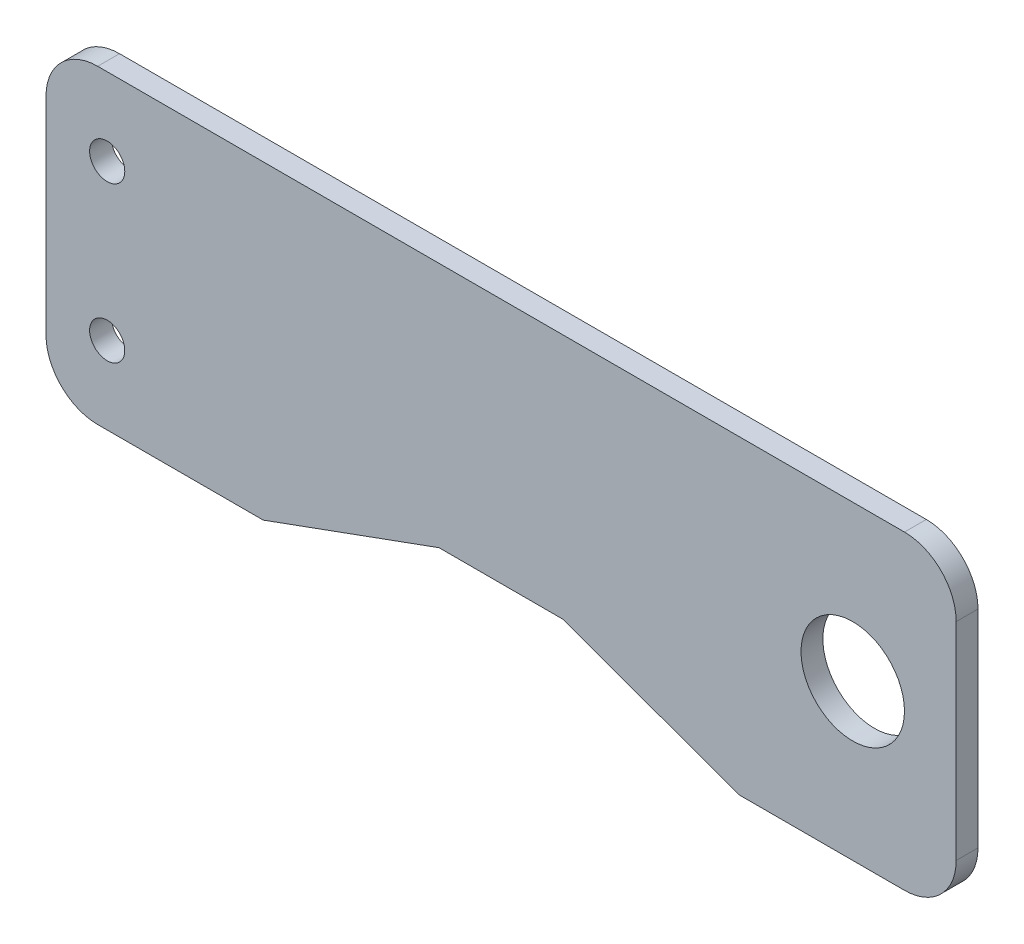
ISO-10303-21;
HEADER;
FILE_DESCRIPTION(('STEP AP214'),'2;1');
FILE_NAME('part.step','',(''),(''),'','','');
FILE_SCHEMA(('AUTOMOTIVE_DESIGN { 1 0 10303 214 1 1 1 1 }'));
ENDSEC;
DATA;
#1=APPLICATION_CONTEXT('core data for automotive mechanical design processes');
#2=APPLICATION_PROTOCOL_DEFINITION('international standard','automotive_design',2000,#1);
#3=PRODUCT_CONTEXT('',#1,'mechanical');
#4=PRODUCT('Part','Part','',(#3));
#5=PRODUCT_RELATED_PRODUCT_CATEGORY('part','',(#4));
#6=PRODUCT_DEFINITION_FORMATION('','',#4);
#7=PRODUCT_DEFINITION_CONTEXT('part definition',#1,'design');
#8=PRODUCT_DEFINITION('design','',#6,#7);
#9=PRODUCT_DEFINITION_SHAPE('','',#8);
#10=(LENGTH_UNIT() NAMED_UNIT(*) SI_UNIT(.MILLI.,.METRE.));
#11=(NAMED_UNIT(*) PLANE_ANGLE_UNIT() SI_UNIT($,.RADIAN.));
#12=(NAMED_UNIT(*) SI_UNIT($,.STERADIAN.) SOLID_ANGLE_UNIT());
#13=UNCERTAINTY_MEASURE_WITH_UNIT(LENGTH_MEASURE(1.E-05),#10,'distance_accuracy_value','');
#14=(GEOMETRIC_REPRESENTATION_CONTEXT(3) GLOBAL_UNCERTAINTY_ASSIGNED_CONTEXT((#13)) GLOBAL_UNIT_ASSIGNED_CONTEXT((#10,
#11,#12)) REPRESENTATION_CONTEXT('',''));
#15=CARTESIAN_POINT('',(0.,0.,0.));
#16=DIRECTION('',(0.,0.,1.));
#17=DIRECTION('',(1.,0.,0.));
#18=AXIS2_PLACEMENT_3D('',#15,#16,#17);
#19=CARTESIAN_POINT('',(-7.29117354288504,-21.4057679765055,2.11));
#20=DIRECTION('',(0.,1.,0.));
#21=DIRECTION('',(0.,0.,1.));
#22=AXIS2_PLACEMENT_3D('',#19,#20,#21);
#23=PLANE('',#22);
#24=DIRECTION('',(1.,0.,0.));
#25=VECTOR('',#24,1.);
#26=CARTESIAN_POINT('',(-7.29117354288504,-21.4057679765055,2.11));
#27=LINE('',#26,#25);
#28=CARTESIAN_POINT('',(-2.29117354288504,-21.4057679765055,2.11));
#29=VERTEX_POINT('',#28);
#30=CARTESIAN_POINT('',(13.708826457115,-21.4057679765055,2.11));
#31=VERTEX_POINT('',#30);
#32=EDGE_CURVE('E149',#29,#31,#27,.T.);
#33=ORIENTED_EDGE('',*,*,#32,.F.);
#34=DIRECTION('',(0.,0.,-1.));
#35=VECTOR('',#34,1.);
#36=CARTESIAN_POINT('',(-2.29117354288504,-21.4057679765055,2.11));
#37=LINE('',#36,#35);
#38=CARTESIAN_POINT('',(-2.29117354288504,-21.4057679765055,0.));
#39=VERTEX_POINT('',#38);
#40=EDGE_CURVE('E195',#29,#39,#37,.T.);
#41=ORIENTED_EDGE('',*,*,#40,.T.);
#42=DIRECTION('',(1.,0.,0.));
#43=VECTOR('',#42,1.);
#44=CARTESIAN_POINT('',(-7.29117354288504,-21.4057679765055,0.));
#45=LINE('',#44,#43);
#46=CARTESIAN_POINT('',(13.708826457115,-21.4057679765055,0.));
#47=VERTEX_POINT('',#46);
#48=EDGE_CURVE('E167',#39,#47,#45,.T.);
#49=ORIENTED_EDGE('',*,*,#48,.T.);
#50=DIRECTION('',(0.,0.,1.));
#51=VECTOR('',#50,1.);
#52=CARTESIAN_POINT('',(13.708826457115,-21.4057679765055,-46.4142767021505));
#53=LINE('',#52,#51);
#54=EDGE_CURVE('E241',#47,#31,#53,.T.);
#55=ORIENTED_EDGE('',*,*,#54,.T.);
#56=EDGE_LOOP('',(#33,#41,#49,#55));
#57=FACE_BOUND('',#56,.T.);
#58=ADVANCED_FACE('F32',(#57),#23,.F.);
#59=CARTESIAN_POINT('',(0.,0.,2.11));
#60=DIRECTION('',(0.,0.,1.));
#61=DIRECTION('',(1.,0.,0.));
#62=AXIS2_PLACEMENT_3D('',#59,#60,#61);
#63=PLANE('',#62);
#64=DIRECTION('',(-1.,0.,0.));
#65=VECTOR('',#64,1.);
#66=CARTESIAN_POINT('',(-7.29117354288504,8.59423202349452,2.11));
#67=LINE('',#66,#65);
#68=CARTESIAN_POINT('',(75.708826457115,8.59423202349452,2.11));
#69=VERTEX_POINT('',#68);
#70=CARTESIAN_POINT('',(-2.29117354288504,8.59423202349452,2.11));
#71=VERTEX_POINT('',#70);
#72=EDGE_CURVE('E153',#69,#71,#67,.T.);
#73=ORIENTED_EDGE('',*,*,#72,.T.);
#74=CARTESIAN_POINT('',(-2.29117354288504,3.59423202349452,2.11));
#75=DIRECTION('',(0.,0.,1.));
#76=DIRECTION('',(1.,0.,0.));
#77=AXIS2_PLACEMENT_3D('',#74,#75,#76);
#78=CIRCLE('',#77,5.);
#79=CARTESIAN_POINT('',(-7.29117354288504,3.59423202349452,2.11));
#80=VERTEX_POINT('',#79);
#81=EDGE_CURVE('E193',#71,#80,#78,.T.);
#82=ORIENTED_EDGE('',*,*,#81,.T.);
#83=DIRECTION('',(0.,-1.,0.));
#84=VECTOR('',#83,1.);
#85=CARTESIAN_POINT('',(-7.29117354288504,-21.4057679765055,2.11));
#86=LINE('',#85,#84);
#87=CARTESIAN_POINT('',(-7.29117354288504,-16.4057679765055,2.11));
#88=VERTEX_POINT('',#87);
#89=EDGE_CURVE('E150',#80,#88,#86,.T.);
#90=ORIENTED_EDGE('',*,*,#89,.T.);
#91=CARTESIAN_POINT('',(-2.29117354288504,-16.4057679765055,2.11));
#92=DIRECTION('',(0.,0.,1.));
#93=DIRECTION('',(1.,0.,0.));
#94=AXIS2_PLACEMENT_3D('',#91,#92,#93);
#95=CIRCLE('',#94,5.);
#96=EDGE_CURVE('E47',#88,#29,#95,.T.);
#97=ORIENTED_EDGE('',*,*,#96,.T.);
#98=ORIENTED_EDGE('',*,*,#32,.T.);
#99=DIRECTION('',(-0.93969262078591,-0.342020143325663,0.));
#100=VECTOR('',#99,1.);
#101=CARTESIAN_POINT('',(13.708826457115,-21.4057679765055,2.11));
#102=LINE('',#101,#100);
#103=CARTESIAN_POINT('',(30.708826457115,-15.2182739939802,2.11));
#104=VERTEX_POINT('',#103);
#105=EDGE_CURVE('E135',#104,#31,#102,.T.);
#106=ORIENTED_EDGE('',*,*,#105,.F.);
#107=DIRECTION('',(-1.,0.,0.));
#108=VECTOR('',#107,1.);
#109=CARTESIAN_POINT('',(30.708826457115,-15.2182739939802,2.11));
#110=LINE('',#109,#108);
#111=CARTESIAN_POINT('',(42.708826457115,-15.2182739939802,2.11));
#112=VERTEX_POINT('',#111);
#113=EDGE_CURVE('E145',#112,#104,#110,.T.);
#114=ORIENTED_EDGE('',*,*,#113,.F.);
#115=DIRECTION('',(-0.93969262078591,0.342020143325663,0.));
#116=VECTOR('',#115,1.);
#117=CARTESIAN_POINT('',(42.708826457115,-15.2182739939802,2.11));
#118=LINE('',#117,#116);
#119=CARTESIAN_POINT('',(59.708826457115,-21.4057679765055,2.11));
#120=VERTEX_POINT('',#119);
#121=EDGE_CURVE('E126',#120,#112,#118,.T.);
#122=ORIENTED_EDGE('',*,*,#121,.F.);
#123=CARTESIAN_POINT('',(75.708826457115,-21.4057679765055,2.11));
#124=VERTEX_POINT('',#123);
#125=EDGE_CURVE('E141',#120,#124,#27,.T.);
#126=ORIENTED_EDGE('',*,*,#125,.T.);
#127=CARTESIAN_POINT('',(75.708826457115,-16.4057679765055,2.11));
#128=DIRECTION('',(0.,0.,1.));
#129=DIRECTION('',(1.,0.,0.));
#130=AXIS2_PLACEMENT_3D('',#127,#128,#129);
#131=CIRCLE('',#130,5.);
#132=CARTESIAN_POINT('',(80.708826457115,-16.4057679765055,2.11));
#133=VERTEX_POINT('',#132);
#134=EDGE_CURVE('E188',#124,#133,#131,.T.);
#135=ORIENTED_EDGE('',*,*,#134,.T.);
#136=DIRECTION('',(0.,1.,0.));
#137=VECTOR('',#136,1.);
#138=CARTESIAN_POINT('',(80.708826457115,-21.4057679765055,2.11));
#139=LINE('',#138,#137);
#140=CARTESIAN_POINT('',(80.708826457115,3.59423202349452,2.11));
#141=VERTEX_POINT('',#140);
#142=EDGE_CURVE('E152',#133,#141,#139,.T.);
#143=ORIENTED_EDGE('',*,*,#142,.T.);
#144=CARTESIAN_POINT('',(75.708826457115,3.59423202349452,2.11));
#145=DIRECTION('',(0.,0.,1.));
#146=DIRECTION('',(1.,0.,0.));
#147=AXIS2_PLACEMENT_3D('',#144,#145,#146);
#148=CIRCLE('',#147,5.);
#149=EDGE_CURVE('E190',#141,#69,#148,.T.);
#150=ORIENTED_EDGE('',*,*,#149,.T.);
#151=EDGE_LOOP('',(#73,#82,#90,#97,#98,#106,#114,#122,#126,#135,#143,#150));
#152=FACE_BOUND('',#151,.T.);
#153=CARTESIAN_POINT('',(70.708826457115,-6.40576797650548,2.11));
#154=DIRECTION('',(0.,0.,1.));
#155=DIRECTION('',(1.,0.,0.));
#156=AXIS2_PLACEMENT_3D('',#153,#154,#155);
#157=CIRCLE('',#156,5.);
#158=CARTESIAN_POINT('',(75.708826457115,-6.40576797650548,2.11));
#159=VERTEX_POINT('',#158);
#160=EDGE_CURVE('E233',#159,#159,#157,.T.);
#161=ORIENTED_EDGE('',*,*,#160,.F.);
#162=EDGE_LOOP('',(#161));
#163=FACE_BOUND('',#162,.T.);
#164=CARTESIAN_POINT('',(-1.37457934004129,1.09423202349452,2.11));
#165=DIRECTION('',(0.,0.,1.));
#166=DIRECTION('',(1.,0.,0.));
#167=AXIS2_PLACEMENT_3D('',#164,#165,#166);
#168=CIRCLE('',#167,1.7);
#169=CARTESIAN_POINT('',(0.325420659958713,1.09423202349452,2.11));
#170=VERTEX_POINT('',#169);
#171=EDGE_CURVE('E163',#170,#170,#168,.T.);
#172=ORIENTED_EDGE('',*,*,#171,.F.);
#173=EDGE_LOOP('',(#172));
#174=FACE_BOUND('',#173,.T.);
#175=CARTESIAN_POINT('',(-1.37457934004129,-13.9057679765055,2.11));
#176=DIRECTION('',(0.,0.,1.));
#177=DIRECTION('',(-1.,0.,0.));
#178=AXIS2_PLACEMENT_3D('',#175,#176,#177);
#179=CIRCLE('',#178,1.7);
#180=CARTESIAN_POINT('',(-3.07457934004129,-13.9057679765055,2.11));
#181=VERTEX_POINT('',#180);
#182=EDGE_CURVE('E222',#181,#181,#179,.T.);
#183=ORIENTED_EDGE('',*,*,#182,.F.);
#184=EDGE_LOOP('',(#183));
#185=FACE_BOUND('',#184,.T.);
#186=ADVANCED_FACE('F139',(#152,#163,#174,#185),#63,.T.);
#187=CARTESIAN_POINT('',(0.,0.,0.));
#188=DIRECTION('',(0.,0.,1.));
#189=DIRECTION('',(1.,0.,0.));
#190=AXIS2_PLACEMENT_3D('',#187,#188,#189);
#191=PLANE('',#190);
#192=CARTESIAN_POINT('',(70.708826457115,-6.40576797650548,0.));
#193=DIRECTION('',(0.,0.,1.));
#194=DIRECTION('',(1.,0.,0.));
#195=AXIS2_PLACEMENT_3D('',#192,#193,#194);
#196=CIRCLE('',#195,5.);
#197=CARTESIAN_POINT('',(75.708826457115,-6.40576797650548,0.));
#198=VERTEX_POINT('',#197);
#199=EDGE_CURVE('E228',#198,#198,#196,.F.);
#200=ORIENTED_EDGE('',*,*,#199,.F.);
#201=EDGE_LOOP('',(#200));
#202=FACE_BOUND('',#201,.T.);
#203=DIRECTION('',(0.,-1.,0.));
#204=VECTOR('',#203,1.);
#205=CARTESIAN_POINT('',(-7.29117354288504,-21.4057679765055,0.));
#206=LINE('',#205,#204);
#207=CARTESIAN_POINT('',(-7.29117354288504,3.59423202349452,0.));
#208=VERTEX_POINT('',#207);
#209=CARTESIAN_POINT('',(-7.29117354288504,-16.4057679765055,0.));
#210=VERTEX_POINT('',#209);
#211=EDGE_CURVE('E162',#208,#210,#206,.T.);
#212=ORIENTED_EDGE('',*,*,#211,.F.);
#213=CARTESIAN_POINT('',(-2.29117354288504,3.59423202349452,0.));
#214=DIRECTION('',(0.,0.,1.));
#215=DIRECTION('',(1.,0.,0.));
#216=AXIS2_PLACEMENT_3D('',#213,#214,#215);
#217=CIRCLE('',#216,5.);
#218=CARTESIAN_POINT('',(-2.29117354288504,8.59423202349452,0.));
#219=VERTEX_POINT('',#218);
#220=EDGE_CURVE('E181',#208,#219,#217,.F.);
#221=ORIENTED_EDGE('',*,*,#220,.T.);
#222=DIRECTION('',(-1.,0.,0.));
#223=VECTOR('',#222,1.);
#224=CARTESIAN_POINT('',(-7.29117354288504,8.59423202349452,0.));
#225=LINE('',#224,#223);
#226=CARTESIAN_POINT('',(75.708826457115,8.59423202349452,0.));
#227=VERTEX_POINT('',#226);
#228=EDGE_CURVE('E159',#227,#219,#225,.T.);
#229=ORIENTED_EDGE('',*,*,#228,.F.);
#230=CARTESIAN_POINT('',(75.708826457115,3.59423202349452,0.));
#231=DIRECTION('',(0.,0.,1.));
#232=DIRECTION('',(1.,0.,0.));
#233=AXIS2_PLACEMENT_3D('',#230,#231,#232);
#234=CIRCLE('',#233,5.);
#235=CARTESIAN_POINT('',(80.708826457115,3.59423202349452,0.));
#236=VERTEX_POINT('',#235);
#237=EDGE_CURVE('E177',#227,#236,#234,.F.);
#238=ORIENTED_EDGE('',*,*,#237,.T.);
#239=DIRECTION('',(0.,1.,0.));
#240=VECTOR('',#239,1.);
#241=CARTESIAN_POINT('',(80.708826457115,-21.4057679765055,0.));
#242=LINE('',#241,#240);
#243=CARTESIAN_POINT('',(80.708826457115,-16.4057679765055,0.));
#244=VERTEX_POINT('',#243);
#245=EDGE_CURVE('E169',#244,#236,#242,.T.);
#246=ORIENTED_EDGE('',*,*,#245,.F.);
#247=CARTESIAN_POINT('',(75.708826457115,-16.4057679765055,0.));
#248=DIRECTION('',(0.,0.,1.));
#249=DIRECTION('',(1.,0.,0.));
#250=AXIS2_PLACEMENT_3D('',#247,#248,#249);
#251=CIRCLE('',#250,5.);
#252=CARTESIAN_POINT('',(75.708826457115,-21.4057679765055,0.));
#253=VERTEX_POINT('',#252);
#254=EDGE_CURVE('E175',#244,#253,#251,.F.);
#255=ORIENTED_EDGE('',*,*,#254,.T.);
#256=CARTESIAN_POINT('',(59.708826457115,-21.4057679765055,0.));
#257=VERTEX_POINT('',#256);
#258=EDGE_CURVE('E166',#257,#253,#45,.T.);
#259=ORIENTED_EDGE('',*,*,#258,.F.);
#260=DIRECTION('',(0.939692620785911,-0.342020143325663,0.));
#261=VECTOR('',#260,1.);
#262=CARTESIAN_POINT('',(42.708826457115,-15.2182739939802,0.));
#263=LINE('',#262,#261);
#264=CARTESIAN_POINT('',(42.708826457115,-15.2182739939802,0.));
#265=VERTEX_POINT('',#264);
#266=EDGE_CURVE('E129',#265,#257,#263,.T.);
#267=ORIENTED_EDGE('',*,*,#266,.F.);
#268=DIRECTION('',(1.,0.,0.));
#269=VECTOR('',#268,1.);
#270=CARTESIAN_POINT('',(30.708826457115,-15.2182739939802,0.));
#271=LINE('',#270,#269);
#272=CARTESIAN_POINT('',(30.708826457115,-15.2182739939802,0.));
#273=VERTEX_POINT('',#272);
#274=EDGE_CURVE('E244',#273,#265,#271,.T.);
#275=ORIENTED_EDGE('',*,*,#274,.F.);
#276=DIRECTION('',(0.939692620785911,0.342020143325663,0.));
#277=VECTOR('',#276,1.);
#278=CARTESIAN_POINT('',(13.708826457115,-21.4057679765055,0.));
#279=LINE('',#278,#277);
#280=EDGE_CURVE('E236',#47,#273,#279,.T.);
#281=ORIENTED_EDGE('',*,*,#280,.F.);
#282=ORIENTED_EDGE('',*,*,#48,.F.);
#283=CARTESIAN_POINT('',(-2.29117354288504,-16.4057679765055,0.));
#284=DIRECTION('',(0.,0.,1.));
#285=DIRECTION('',(1.,0.,0.));
#286=AXIS2_PLACEMENT_3D('',#283,#284,#285);
#287=CIRCLE('',#286,5.);
#288=EDGE_CURVE('E179',#39,#210,#287,.F.);
#289=ORIENTED_EDGE('',*,*,#288,.T.);
#290=EDGE_LOOP('',(#212,#221,#229,#238,#246,#255,#259,#267,#275,#281,#282,#289));
#291=FACE_BOUND('',#290,.T.);
#292=CARTESIAN_POINT('',(-1.37457934004129,1.09423202349452,0.));
#293=DIRECTION('',(0.,0.,1.));
#294=DIRECTION('',(1.,0.,0.));
#295=AXIS2_PLACEMENT_3D('',#292,#293,#294);
#296=CIRCLE('',#295,1.7);
#297=CARTESIAN_POINT('',(0.325420659958713,1.09423202349452,0.));
#298=VERTEX_POINT('',#297);
#299=EDGE_CURVE('E219',#298,#298,#296,.T.);
#300=ORIENTED_EDGE('',*,*,#299,.T.);
#301=EDGE_LOOP('',(#300));
#302=FACE_BOUND('',#301,.T.);
#303=CARTESIAN_POINT('',(-1.37457934004129,-13.9057679765055,0.));
#304=DIRECTION('',(0.,0.,1.));
#305=DIRECTION('',(-1.,0.,0.));
#306=AXIS2_PLACEMENT_3D('',#303,#304,#305);
#307=CIRCLE('',#306,1.7);
#308=CARTESIAN_POINT('',(-3.07457934004129,-13.9057679765055,0.));
#309=VERTEX_POINT('',#308);
#310=EDGE_CURVE('E225',#309,#309,#307,.T.);
#311=ORIENTED_EDGE('',*,*,#310,.T.);
#312=EDGE_LOOP('',(#311));
#313=FACE_BOUND('',#312,.T.);
#314=ADVANCED_FACE('F206',(#202,#291,#302,#313),#191,.F.);
#315=CARTESIAN_POINT('',(-7.29117354288504,8.59423202349452,2.11));
#316=DIRECTION('',(0.,-1.,0.));
#317=DIRECTION('',(0.,0.,-1.));
#318=AXIS2_PLACEMENT_3D('',#315,#316,#317);
#319=PLANE('',#318);
#320=ORIENTED_EDGE('',*,*,#228,.T.);
#321=DIRECTION('',(0.,0.,-1.));
#322=VECTOR('',#321,1.);
#323=CARTESIAN_POINT('',(-2.29117354288504,8.59423202349452,2.11));
#324=LINE('',#323,#322);
#325=EDGE_CURVE('E186',#219,#71,#324,.F.);
#326=ORIENTED_EDGE('',*,*,#325,.T.);
#327=ORIENTED_EDGE('',*,*,#72,.F.);
#328=DIRECTION('',(0.,0.,-1.));
#329=VECTOR('',#328,1.);
#330=CARTESIAN_POINT('',(75.708826457115,8.59423202349452,2.11));
#331=LINE('',#330,#329);
#332=EDGE_CURVE('E183',#69,#227,#331,.T.);
#333=ORIENTED_EDGE('',*,*,#332,.T.);
#334=EDGE_LOOP('',(#320,#326,#327,#333));
#335=FACE_BOUND('',#334,.T.);
#336=ADVANCED_FACE('F215',(#335),#319,.F.);
#337=CARTESIAN_POINT('',(-7.29117354288504,-21.4057679765055,2.11));
#338=DIRECTION('',(1.,0.,0.));
#339=DIRECTION('',(0.,0.,-1.));
#340=AXIS2_PLACEMENT_3D('',#337,#338,#339);
#341=PLANE('',#340);
#342=ORIENTED_EDGE('',*,*,#89,.F.);
#343=DIRECTION('',(0.,0.,-1.));
#344=VECTOR('',#343,1.);
#345=CARTESIAN_POINT('',(-7.29117354288504,3.59423202349452,2.11));
#346=LINE('',#345,#344);
#347=EDGE_CURVE('E172',#80,#208,#346,.T.);
#348=ORIENTED_EDGE('',*,*,#347,.T.);
#349=ORIENTED_EDGE('',*,*,#211,.T.);
#350=DIRECTION('',(0.,0.,-1.));
#351=VECTOR('',#350,1.);
#352=CARTESIAN_POINT('',(-7.29117354288504,-16.4057679765055,2.11));
#353=LINE('',#352,#351);
#354=EDGE_CURVE('E158',#210,#88,#353,.F.);
#355=ORIENTED_EDGE('',*,*,#354,.T.);
#356=EDGE_LOOP('',(#342,#348,#349,#355));
#357=FACE_BOUND('',#356,.T.);
#358=ADVANCED_FACE('F269',(#357),#341,.F.);
#359=ORIENTED_EDGE('',*,*,#258,.T.);
#360=DIRECTION('',(0.,0.,-1.));
#361=VECTOR('',#360,1.);
#362=CARTESIAN_POINT('',(75.708826457115,-21.4057679765055,2.11));
#363=LINE('',#362,#361);
#364=EDGE_CURVE('E11',#253,#124,#363,.F.);
#365=ORIENTED_EDGE('',*,*,#364,.T.);
#366=ORIENTED_EDGE('',*,*,#125,.F.);
#367=DIRECTION('',(0.,0.,1.));
#368=VECTOR('',#367,1.);
#369=CARTESIAN_POINT('',(59.708826457115,-21.4057679765055,-46.4142767021505));
#370=LINE('',#369,#368);
#371=EDGE_CURVE('E122',#257,#120,#370,.T.);
#372=ORIENTED_EDGE('',*,*,#371,.F.);
#373=EDGE_LOOP('',(#359,#365,#366,#372));
#374=FACE_BOUND('',#373,.T.);
#375=ADVANCED_FACE('F147',(#374),#23,.F.);
#376=CARTESIAN_POINT('',(80.708826457115,-21.4057679765055,2.11));
#377=DIRECTION('',(-1.,0.,0.));
#378=DIRECTION('',(0.,0.,1.));
#379=AXIS2_PLACEMENT_3D('',#376,#377,#378);
#380=PLANE('',#379);
#381=ORIENTED_EDGE('',*,*,#245,.T.);
#382=DIRECTION('',(0.,0.,-1.));
#383=VECTOR('',#382,1.);
#384=CARTESIAN_POINT('',(80.708826457115,3.59423202349452,2.11));
#385=LINE('',#384,#383);
#386=EDGE_CURVE('E40',#236,#141,#385,.F.);
#387=ORIENTED_EDGE('',*,*,#386,.T.);
#388=ORIENTED_EDGE('',*,*,#142,.F.);
#389=DIRECTION('',(0.,0.,-1.));
#390=VECTOR('',#389,1.);
#391=CARTESIAN_POINT('',(80.708826457115,-16.4057679765055,2.11));
#392=LINE('',#391,#390);
#393=EDGE_CURVE('E198',#133,#244,#392,.T.);
#394=ORIENTED_EDGE('',*,*,#393,.T.);
#395=EDGE_LOOP('',(#381,#387,#388,#394));
#396=FACE_BOUND('',#395,.T.);
#397=ADVANCED_FACE('F202',(#396),#380,.F.);
#398=CARTESIAN_POINT('',(-1.37457934004129,1.09423202349452,2.11));
#399=DIRECTION('',(0.,0.,-1.));
#400=DIRECTION('',(-1.,0.,0.));
#401=AXIS2_PLACEMENT_3D('',#398,#399,#400);
#402=CYLINDRICAL_SURFACE('',#401,1.7);
#403=ORIENTED_EDGE('',*,*,#171,.T.);
#404=EDGE_LOOP('',(#403));
#405=FACE_BOUND('',#404,.T.);
#406=ORIENTED_EDGE('',*,*,#299,.F.);
#407=EDGE_LOOP('',(#406));
#408=FACE_BOUND('',#407,.T.);
#409=ADVANCED_FACE('F274',(#405,#408),#402,.F.);
#410=CARTESIAN_POINT('',(-1.37457934004129,-13.9057679765055,2.11));
#411=DIRECTION('',(0.,0.,-1.));
#412=DIRECTION('',(-1.,0.,0.));
#413=AXIS2_PLACEMENT_3D('',#410,#411,#412);
#414=CYLINDRICAL_SURFACE('',#413,1.7);
#415=ORIENTED_EDGE('',*,*,#182,.T.);
#416=EDGE_LOOP('',(#415));
#417=FACE_BOUND('',#416,.T.);
#418=ORIENTED_EDGE('',*,*,#310,.F.);
#419=EDGE_LOOP('',(#418));
#420=FACE_BOUND('',#419,.T.);
#421=ADVANCED_FACE('F304',(#417,#420),#414,.F.);
#422=CARTESIAN_POINT('',(70.708826457115,-6.40576797650548,-14.142135623731));
#423=DIRECTION('',(0.,0.,1.));
#424=DIRECTION('',(1.,0.,0.));
#425=AXIS2_PLACEMENT_3D('',#422,#423,#424);
#426=CYLINDRICAL_SURFACE('',#425,5.);
#427=ORIENTED_EDGE('',*,*,#199,.T.);
#428=EDGE_LOOP('',(#427));
#429=FACE_BOUND('',#428,.T.);
#430=ORIENTED_EDGE('',*,*,#160,.T.);
#431=EDGE_LOOP('',(#430));
#432=FACE_BOUND('',#431,.T.);
#433=ADVANCED_FACE('F297',(#429,#432),#426,.F.);
#434=CARTESIAN_POINT('',(13.708826457115,-21.4057679765055,-46.4142767021505));
#435=DIRECTION('',(-0.342020143325663,0.939692620785911,0.));
#436=DIRECTION('',(-0.939692620785911,-0.342020143325663,0.));
#437=AXIS2_PLACEMENT_3D('',#434,#435,#436);
#438=PLANE('',#437);
#439=ORIENTED_EDGE('',*,*,#280,.T.);
#440=DIRECTION('',(0.,0.,1.));
#441=VECTOR('',#440,1.);
#442=CARTESIAN_POINT('',(30.708826457115,-15.2182739939802,-46.4142767021505));
#443=LINE('',#442,#441);
#444=EDGE_CURVE('E239',#273,#104,#443,.T.);
#445=ORIENTED_EDGE('',*,*,#444,.T.);
#446=ORIENTED_EDGE('',*,*,#105,.T.);
#447=ORIENTED_EDGE('',*,*,#54,.F.);
#448=EDGE_LOOP('',(#439,#445,#446,#447));
#449=FACE_BOUND('',#448,.T.);
#450=ADVANCED_FACE('F295',(#449),#438,.F.);
#451=CARTESIAN_POINT('',(30.708826457115,-15.2182739939802,-46.4142767021505));
#452=DIRECTION('',(0.,1.,0.));
#453=DIRECTION('',(0.,0.,1.));
#454=AXIS2_PLACEMENT_3D('',#451,#452,#453);
#455=PLANE('',#454);
#456=ORIENTED_EDGE('',*,*,#274,.T.);
#457=DIRECTION('',(0.,0.,1.));
#458=VECTOR('',#457,1.);
#459=CARTESIAN_POINT('',(42.708826457115,-15.2182739939802,-46.4142767021505));
#460=LINE('',#459,#458);
#461=EDGE_CURVE('E134',#265,#112,#460,.T.);
#462=ORIENTED_EDGE('',*,*,#461,.T.);
#463=ORIENTED_EDGE('',*,*,#113,.T.);
#464=ORIENTED_EDGE('',*,*,#444,.F.);
#465=EDGE_LOOP('',(#456,#462,#463,#464));
#466=FACE_BOUND('',#465,.T.);
#467=ADVANCED_FACE('F252',(#466),#455,.F.);
#468=CARTESIAN_POINT('',(42.708826457115,-15.2182739939802,-46.4142767021505));
#469=DIRECTION('',(0.342020143325663,0.939692620785911,0.));
#470=DIRECTION('',(-0.939692620785911,0.342020143325663,0.));
#471=AXIS2_PLACEMENT_3D('',#468,#469,#470);
#472=PLANE('',#471);
#473=ORIENTED_EDGE('',*,*,#266,.T.);
#474=ORIENTED_EDGE('',*,*,#371,.T.);
#475=ORIENTED_EDGE('',*,*,#121,.T.);
#476=ORIENTED_EDGE('',*,*,#461,.F.);
#477=EDGE_LOOP('',(#473,#474,#475,#476));
#478=FACE_BOUND('',#477,.T.);
#479=ADVANCED_FACE('F124',(#478),#472,.F.);
#480=CARTESIAN_POINT('',(-2.29117354288504,3.59423202349452,2.11));
#481=DIRECTION('',(0.,0.,-1.));
#482=DIRECTION('',(-1.,0.,0.));
#483=AXIS2_PLACEMENT_3D('',#480,#481,#482);
#484=CYLINDRICAL_SURFACE('',#483,5.);
#485=ORIENTED_EDGE('',*,*,#81,.F.);
#486=ORIENTED_EDGE('',*,*,#325,.F.);
#487=ORIENTED_EDGE('',*,*,#220,.F.);
#488=ORIENTED_EDGE('',*,*,#347,.F.);
#489=EDGE_LOOP('',(#485,#486,#487,#488));
#490=FACE_BOUND('',#489,.T.);
#491=ADVANCED_FACE('F282',(#490),#484,.T.);
#492=CARTESIAN_POINT('',(-2.29117354288504,-16.4057679765055,2.11));
#493=DIRECTION('',(0.,0.,-1.));
#494=DIRECTION('',(-1.,0.,0.));
#495=AXIS2_PLACEMENT_3D('',#492,#493,#494);
#496=CYLINDRICAL_SURFACE('',#495,5.);
#497=ORIENTED_EDGE('',*,*,#96,.F.);
#498=ORIENTED_EDGE('',*,*,#354,.F.);
#499=ORIENTED_EDGE('',*,*,#288,.F.);
#500=ORIENTED_EDGE('',*,*,#40,.F.);
#501=EDGE_LOOP('',(#497,#498,#499,#500));
#502=FACE_BOUND('',#501,.T.);
#503=ADVANCED_FACE('F258',(#502),#496,.T.);
#504=CARTESIAN_POINT('',(75.708826457115,3.59423202349452,2.11));
#505=DIRECTION('',(0.,0.,-1.));
#506=DIRECTION('',(-1.,0.,0.));
#507=AXIS2_PLACEMENT_3D('',#504,#505,#506);
#508=CYLINDRICAL_SURFACE('',#507,5.);
#509=ORIENTED_EDGE('',*,*,#149,.F.);
#510=ORIENTED_EDGE('',*,*,#386,.F.);
#511=ORIENTED_EDGE('',*,*,#237,.F.);
#512=ORIENTED_EDGE('',*,*,#332,.F.);
#513=EDGE_LOOP('',(#509,#510,#511,#512));
#514=FACE_BOUND('',#513,.T.);
#515=ADVANCED_FACE('F212',(#514),#508,.T.);
#516=CARTESIAN_POINT('',(75.708826457115,-16.4057679765055,2.11));
#517=DIRECTION('',(0.,0.,-1.));
#518=DIRECTION('',(-1.,0.,0.));
#519=AXIS2_PLACEMENT_3D('',#516,#517,#518);
#520=CYLINDRICAL_SURFACE('',#519,5.);
#521=ORIENTED_EDGE('',*,*,#134,.F.);
#522=ORIENTED_EDGE('',*,*,#364,.F.);
#523=ORIENTED_EDGE('',*,*,#254,.F.);
#524=ORIENTED_EDGE('',*,*,#393,.F.);
#525=EDGE_LOOP('',(#521,#522,#523,#524));
#526=FACE_BOUND('',#525,.T.);
#527=ADVANCED_FACE('F34',(#526),#520,.T.);
#528=CLOSED_SHELL('',(#58,#186,#314,#336,#358,#375,#397,#409,#421,#433,#450,#467,#479,#491,#503,
#515,#527));
#529=MANIFOLD_SOLID_BREP('B2',#528);
#530=ADVANCED_BREP_SHAPE_REPRESENTATION('',(#18,#529),#14);
#531=SHAPE_DEFINITION_REPRESENTATION(#9,#530);
ENDSEC;
END-ISO-10303-21;
